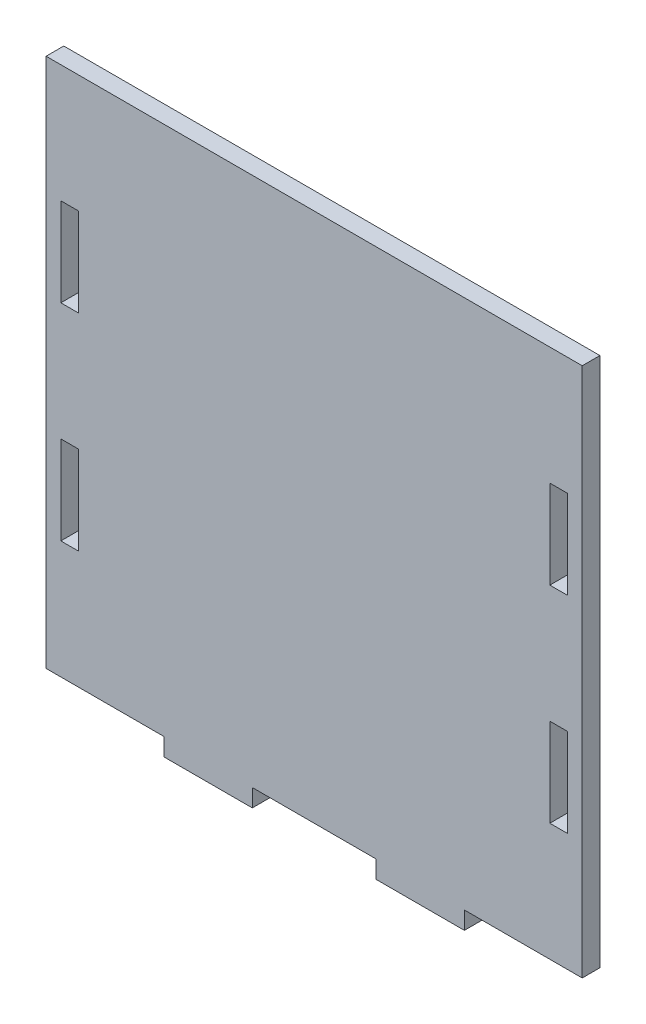
ISO-10303-21;
HEADER;
FILE_DESCRIPTION(('STEP AP214'),'2;1');
FILE_NAME('part.step','',(''),(''),'','','');
FILE_SCHEMA(('AUTOMOTIVE_DESIGN { 1 0 10303 214 1 1 1 1 }'));
ENDSEC;
DATA;
#1=APPLICATION_CONTEXT('core data for automotive mechanical design processes');
#2=APPLICATION_PROTOCOL_DEFINITION('international standard','automotive_design',2000,#1);
#3=PRODUCT_CONTEXT('',#1,'mechanical');
#4=PRODUCT('Part','Part','',(#3));
#5=PRODUCT_RELATED_PRODUCT_CATEGORY('part','',(#4));
#6=PRODUCT_DEFINITION_FORMATION('','',#4);
#7=PRODUCT_DEFINITION_CONTEXT('part definition',#1,'design');
#8=PRODUCT_DEFINITION('design','',#6,#7);
#9=PRODUCT_DEFINITION_SHAPE('','',#8);
#10=(LENGTH_UNIT() NAMED_UNIT(*) SI_UNIT(.MILLI.,.METRE.));
#11=(NAMED_UNIT(*) PLANE_ANGLE_UNIT() SI_UNIT($,.RADIAN.));
#12=(NAMED_UNIT(*) SI_UNIT($,.STERADIAN.) SOLID_ANGLE_UNIT());
#13=UNCERTAINTY_MEASURE_WITH_UNIT(LENGTH_MEASURE(1.E-05),#10,'distance_accuracy_value','');
#14=(GEOMETRIC_REPRESENTATION_CONTEXT(3) GLOBAL_UNCERTAINTY_ASSIGNED_CONTEXT((#13)) GLOBAL_UNIT_ASSIGNED_CONTEXT((#10,
#11,#12)) REPRESENTATION_CONTEXT('',''));
#15=CARTESIAN_POINT('',(0.,0.,0.));
#16=DIRECTION('',(0.,0.,1.));
#17=DIRECTION('',(1.,0.,0.));
#18=AXIS2_PLACEMENT_3D('',#15,#16,#17);
#19=CARTESIAN_POINT('',(45.5,0.,3.));
#20=DIRECTION('',(1.,0.,0.));
#21=DIRECTION('',(0.,1.,0.));
#22=AXIS2_PLACEMENT_3D('',#19,#20,#21);
#23=PLANE('',#22);
#24=DIRECTION('',(0.,-1.,0.));
#25=VECTOR('',#24,1.);
#26=CARTESIAN_POINT('',(45.5,0.,0.));
#27=LINE('',#26,#25);
#28=CARTESIAN_POINT('',(45.5,45.,0.));
#29=VERTEX_POINT('',#28);
#30=CARTESIAN_POINT('',(45.5,-45.,0.));
#31=VERTEX_POINT('',#30);
#32=EDGE_CURVE('E304',#29,#31,#27,.T.);
#33=ORIENTED_EDGE('',*,*,#32,.F.);
#34=DIRECTION('',(0.,0.,-1.));
#35=VECTOR('',#34,1.);
#36=CARTESIAN_POINT('',(45.5,45.,3.));
#37=LINE('',#36,#35);
#38=CARTESIAN_POINT('',(45.5,45.,3.));
#39=VERTEX_POINT('',#38);
#40=EDGE_CURVE('E11',#39,#29,#37,.T.);
#41=ORIENTED_EDGE('',*,*,#40,.F.);
#42=DIRECTION('',(0.,-1.,0.));
#43=VECTOR('',#42,1.);
#44=CARTESIAN_POINT('',(45.5,0.,3.));
#45=LINE('',#44,#43);
#46=CARTESIAN_POINT('',(45.5,-45.,3.));
#47=VERTEX_POINT('',#46);
#48=EDGE_CURVE('E545',#39,#47,#45,.T.);
#49=ORIENTED_EDGE('',*,*,#48,.T.);
#50=DIRECTION('',(0.,0.,-1.));
#51=VECTOR('',#50,1.);
#52=CARTESIAN_POINT('',(45.5,-45.,3.));
#53=LINE('',#52,#51);
#54=EDGE_CURVE('E148',#47,#31,#53,.T.);
#55=ORIENTED_EDGE('',*,*,#54,.T.);
#56=EDGE_LOOP('',(#33,#41,#49,#55));
#57=FACE_BOUND('',#56,.T.);
#58=ADVANCED_FACE('F35',(#57),#23,.T.);
#59=CARTESIAN_POINT('',(0.,45.,3.));
#60=DIRECTION('',(0.,1.,0.));
#61=DIRECTION('',(-1.,0.,0.));
#62=AXIS2_PLACEMENT_3D('',#59,#60,#61);
#63=PLANE('',#62);
#64=DIRECTION('',(1.,0.,0.));
#65=VECTOR('',#64,1.);
#66=CARTESIAN_POINT('',(0.,45.,0.));
#67=LINE('',#66,#65);
#68=CARTESIAN_POINT('',(-45.5,45.,0.));
#69=VERTEX_POINT('',#68);
#70=EDGE_CURVE('E307',#69,#29,#67,.T.);
#71=ORIENTED_EDGE('',*,*,#70,.F.);
#72=DIRECTION('',(0.,0.,-1.));
#73=VECTOR('',#72,1.);
#74=CARTESIAN_POINT('',(-45.5,45.,3.));
#75=LINE('',#74,#73);
#76=CARTESIAN_POINT('',(-45.5,45.,3.));
#77=VERTEX_POINT('',#76);
#78=EDGE_CURVE('E45',#77,#69,#75,.T.);
#79=ORIENTED_EDGE('',*,*,#78,.F.);
#80=DIRECTION('',(1.,0.,0.));
#81=VECTOR('',#80,1.);
#82=CARTESIAN_POINT('',(0.,45.,3.));
#83=LINE('',#82,#81);
#84=EDGE_CURVE('E547',#77,#39,#83,.T.);
#85=ORIENTED_EDGE('',*,*,#84,.T.);
#86=ORIENTED_EDGE('',*,*,#40,.T.);
#87=EDGE_LOOP('',(#71,#79,#85,#86));
#88=FACE_BOUND('',#87,.T.);
#89=ADVANCED_FACE('F417',(#88),#63,.T.);
#90=CARTESIAN_POINT('',(-45.5,0.,3.));
#91=DIRECTION('',(1.,0.,0.));
#92=DIRECTION('',(0.,1.,0.));
#93=AXIS2_PLACEMENT_3D('',#90,#91,#92);
#94=PLANE('',#93);
#95=DIRECTION('',(0.,-1.,0.));
#96=VECTOR('',#95,1.);
#97=CARTESIAN_POINT('',(-45.5,0.,0.));
#98=LINE('',#97,#96);
#99=CARTESIAN_POINT('',(-45.5,-45.,0.));
#100=VERTEX_POINT('',#99);
#101=EDGE_CURVE('E310',#69,#100,#98,.T.);
#102=ORIENTED_EDGE('',*,*,#101,.T.);
#103=DIRECTION('',(0.,0.,-1.));
#104=VECTOR('',#103,1.);
#105=CARTESIAN_POINT('',(-45.5,-45.,3.));
#106=LINE('',#105,#104);
#107=CARTESIAN_POINT('',(-45.5,-45.,3.));
#108=VERTEX_POINT('',#107);
#109=EDGE_CURVE('E350',#108,#100,#106,.T.);
#110=ORIENTED_EDGE('',*,*,#109,.F.);
#111=DIRECTION('',(0.,-1.,0.));
#112=VECTOR('',#111,1.);
#113=CARTESIAN_POINT('',(-45.5,0.,3.));
#114=LINE('',#113,#112);
#115=EDGE_CURVE('E550',#77,#108,#114,.T.);
#116=ORIENTED_EDGE('',*,*,#115,.F.);
#117=ORIENTED_EDGE('',*,*,#78,.T.);
#118=EDGE_LOOP('',(#102,#110,#116,#117));
#119=FACE_BOUND('',#118,.T.);
#120=ADVANCED_FACE('F422',(#119),#94,.F.);
#121=CARTESIAN_POINT('',(0.,-45.,3.));
#122=DIRECTION('',(0.,1.,0.));
#123=DIRECTION('',(-1.,0.,0.));
#124=AXIS2_PLACEMENT_3D('',#121,#122,#123);
#125=PLANE('',#124);
#126=DIRECTION('',(1.,0.,0.));
#127=VECTOR('',#126,1.);
#128=CARTESIAN_POINT('',(0.,-45.,0.));
#129=LINE('',#128,#127);
#130=CARTESIAN_POINT('',(-25.5,-45.,0.));
#131=VERTEX_POINT('',#130);
#132=EDGE_CURVE('E313',#100,#131,#129,.T.);
#133=ORIENTED_EDGE('',*,*,#132,.T.);
#134=DIRECTION('',(0.,0.,-1.));
#135=VECTOR('',#134,1.);
#136=CARTESIAN_POINT('',(-25.5,-45.,3.));
#137=LINE('',#136,#135);
#138=CARTESIAN_POINT('',(-25.5,-45.,3.));
#139=VERTEX_POINT('',#138);
#140=EDGE_CURVE('E347',#139,#131,#137,.T.);
#141=ORIENTED_EDGE('',*,*,#140,.F.);
#142=DIRECTION('',(1.,0.,0.));
#143=VECTOR('',#142,1.);
#144=CARTESIAN_POINT('',(0.,-45.,3.));
#145=LINE('',#144,#143);
#146=EDGE_CURVE('E254',#108,#139,#145,.T.);
#147=ORIENTED_EDGE('',*,*,#146,.F.);
#148=ORIENTED_EDGE('',*,*,#109,.T.);
#149=EDGE_LOOP('',(#133,#141,#147,#148));
#150=FACE_BOUND('',#149,.T.);
#151=ADVANCED_FACE('F475',(#150),#125,.F.);
#152=CARTESIAN_POINT('',(-25.5,0.,3.));
#153=DIRECTION('',(1.,0.,0.));
#154=DIRECTION('',(0.,0.,-1.));
#155=AXIS2_PLACEMENT_3D('',#152,#153,#154);
#156=PLANE('',#155);
#157=DIRECTION('',(0.,-1.,0.));
#158=VECTOR('',#157,1.);
#159=CARTESIAN_POINT('',(-25.5,0.,0.));
#160=LINE('',#159,#158);
#161=CARTESIAN_POINT('',(-25.5,-48.,0.));
#162=VERTEX_POINT('',#161);
#163=EDGE_CURVE('E316',#131,#162,#160,.T.);
#164=ORIENTED_EDGE('',*,*,#163,.T.);
#165=DIRECTION('',(0.,0.,-1.));
#166=VECTOR('',#165,1.);
#167=CARTESIAN_POINT('',(-25.5,-48.,3.));
#168=LINE('',#167,#166);
#169=CARTESIAN_POINT('',(-25.5,-48.,3.));
#170=VERTEX_POINT('',#169);
#171=EDGE_CURVE('E344',#170,#162,#168,.T.);
#172=ORIENTED_EDGE('',*,*,#171,.F.);
#173=DIRECTION('',(0.,-1.,0.));
#174=VECTOR('',#173,1.);
#175=CARTESIAN_POINT('',(-25.5,0.,3.));
#176=LINE('',#175,#174);
#177=EDGE_CURVE('E554',#139,#170,#176,.T.);
#178=ORIENTED_EDGE('',*,*,#177,.F.);
#179=ORIENTED_EDGE('',*,*,#140,.T.);
#180=EDGE_LOOP('',(#164,#172,#178,#179));
#181=FACE_BOUND('',#180,.T.);
#182=ADVANCED_FACE('F485',(#181),#156,.F.);
#183=CARTESIAN_POINT('',(0.,-48.,3.));
#184=DIRECTION('',(0.,1.,0.));
#185=DIRECTION('',(-1.,0.,0.));
#186=AXIS2_PLACEMENT_3D('',#183,#184,#185);
#187=PLANE('',#186);
#188=DIRECTION('',(1.,0.,0.));
#189=VECTOR('',#188,1.);
#190=CARTESIAN_POINT('',(0.,-48.,0.));
#191=LINE('',#190,#189);
#192=CARTESIAN_POINT('',(-10.5,-48.,0.));
#193=VERTEX_POINT('',#192);
#194=EDGE_CURVE('E321',#162,#193,#191,.T.);
#195=ORIENTED_EDGE('',*,*,#194,.T.);
#196=DIRECTION('',(0.,0.,-1.));
#197=VECTOR('',#196,1.);
#198=CARTESIAN_POINT('',(-10.5,-48.,3.));
#199=LINE('',#198,#197);
#200=CARTESIAN_POINT('',(-10.5,-48.,3.));
#201=VERTEX_POINT('',#200);
#202=EDGE_CURVE('E342',#201,#193,#199,.T.);
#203=ORIENTED_EDGE('',*,*,#202,.F.);
#204=DIRECTION('',(1.,0.,0.));
#205=VECTOR('',#204,1.);
#206=CARTESIAN_POINT('',(0.,-48.,3.));
#207=LINE('',#206,#205);
#208=EDGE_CURVE('E557',#170,#201,#207,.T.);
#209=ORIENTED_EDGE('',*,*,#208,.F.);
#210=ORIENTED_EDGE('',*,*,#171,.T.);
#211=EDGE_LOOP('',(#195,#203,#209,#210));
#212=FACE_BOUND('',#211,.T.);
#213=ADVANCED_FACE('F497',(#212),#187,.F.);
#214=CARTESIAN_POINT('',(-10.5,0.,3.));
#215=DIRECTION('',(1.,0.,0.));
#216=DIRECTION('',(0.,0.,-1.));
#217=AXIS2_PLACEMENT_3D('',#214,#215,#216);
#218=PLANE('',#217);
#219=DIRECTION('',(0.,-1.,0.));
#220=VECTOR('',#219,1.);
#221=CARTESIAN_POINT('',(-10.5,0.,0.));
#222=LINE('',#221,#220);
#223=CARTESIAN_POINT('',(-10.5,-45.,0.));
#224=VERTEX_POINT('',#223);
#225=EDGE_CURVE('E324',#224,#193,#222,.T.);
#226=ORIENTED_EDGE('',*,*,#225,.F.);
#227=DIRECTION('',(0.,0.,-1.));
#228=VECTOR('',#227,1.);
#229=CARTESIAN_POINT('',(-10.5,-45.,3.));
#230=LINE('',#229,#228);
#231=CARTESIAN_POINT('',(-10.5,-45.,3.));
#232=VERTEX_POINT('',#231);
#233=EDGE_CURVE('E340',#232,#224,#230,.T.);
#234=ORIENTED_EDGE('',*,*,#233,.F.);
#235=DIRECTION('',(0.,-1.,0.));
#236=VECTOR('',#235,1.);
#237=CARTESIAN_POINT('',(-10.5,0.,3.));
#238=LINE('',#237,#236);
#239=EDGE_CURVE('E559',#232,#201,#238,.T.);
#240=ORIENTED_EDGE('',*,*,#239,.T.);
#241=ORIENTED_EDGE('',*,*,#202,.T.);
#242=EDGE_LOOP('',(#226,#234,#240,#241));
#243=FACE_BOUND('',#242,.T.);
#244=ADVANCED_FACE('F489',(#243),#218,.T.);
#245=CARTESIAN_POINT('',(10.5,-45.,0.));
#246=VERTEX_POINT('',#245);
#247=EDGE_CURVE('E318',#224,#246,#129,.T.);
#248=ORIENTED_EDGE('',*,*,#247,.T.);
#249=DIRECTION('',(0.,0.,-1.));
#250=VECTOR('',#249,1.);
#251=CARTESIAN_POINT('',(10.5,-45.,3.));
#252=LINE('',#251,#250);
#253=CARTESIAN_POINT('',(10.5,-45.,3.));
#254=VERTEX_POINT('',#253);
#255=EDGE_CURVE('E337',#254,#246,#252,.T.);
#256=ORIENTED_EDGE('',*,*,#255,.F.);
#257=EDGE_CURVE('E253',#232,#254,#145,.T.);
#258=ORIENTED_EDGE('',*,*,#257,.F.);
#259=ORIENTED_EDGE('',*,*,#233,.T.);
#260=EDGE_LOOP('',(#248,#256,#258,#259));
#261=FACE_BOUND('',#260,.T.);
#262=ADVANCED_FACE('F476',(#261),#125,.F.);
#263=CARTESIAN_POINT('',(10.5,0.,3.));
#264=DIRECTION('',(1.,0.,0.));
#265=DIRECTION('',(0.,0.,-1.));
#266=AXIS2_PLACEMENT_3D('',#263,#264,#265);
#267=PLANE('',#266);
#268=DIRECTION('',(0.,-1.,0.));
#269=VECTOR('',#268,1.);
#270=CARTESIAN_POINT('',(10.5,0.,0.));
#271=LINE('',#270,#269);
#272=CARTESIAN_POINT('',(10.5,-48.,0.));
#273=VERTEX_POINT('',#272);
#274=EDGE_CURVE('E327',#246,#273,#271,.T.);
#275=ORIENTED_EDGE('',*,*,#274,.T.);
#276=DIRECTION('',(0.,0.,-1.));
#277=VECTOR('',#276,1.);
#278=CARTESIAN_POINT('',(10.5,-48.,3.));
#279=LINE('',#278,#277);
#280=CARTESIAN_POINT('',(10.5,-48.,3.));
#281=VERTEX_POINT('',#280);
#282=EDGE_CURVE('E247',#281,#273,#279,.T.);
#283=ORIENTED_EDGE('',*,*,#282,.F.);
#284=DIRECTION('',(0.,-1.,0.));
#285=VECTOR('',#284,1.);
#286=CARTESIAN_POINT('',(10.5,0.,3.));
#287=LINE('',#286,#285);
#288=EDGE_CURVE('E235',#254,#281,#287,.T.);
#289=ORIENTED_EDGE('',*,*,#288,.F.);
#290=ORIENTED_EDGE('',*,*,#255,.T.);
#291=EDGE_LOOP('',(#275,#283,#289,#290));
#292=FACE_BOUND('',#291,.T.);
#293=ADVANCED_FACE('F488',(#292),#267,.F.);
#294=CARTESIAN_POINT('',(0.,-48.,3.));
#295=DIRECTION('',(0.,1.,0.));
#296=DIRECTION('',(0.,0.,1.));
#297=AXIS2_PLACEMENT_3D('',#294,#295,#296);
#298=PLANE('',#297);
#299=DIRECTION('',(1.,0.,0.));
#300=VECTOR('',#299,1.);
#301=CARTESIAN_POINT('',(0.,-48.,0.));
#302=LINE('',#301,#300);
#303=CARTESIAN_POINT('',(25.5,-48.,0.));
#304=VERTEX_POINT('',#303);
#305=EDGE_CURVE('E243',#273,#304,#302,.T.);
#306=ORIENTED_EDGE('',*,*,#305,.T.);
#307=DIRECTION('',(0.,0.,-1.));
#308=VECTOR('',#307,1.);
#309=CARTESIAN_POINT('',(25.5,-48.,3.));
#310=LINE('',#309,#308);
#311=CARTESIAN_POINT('',(25.5,-48.,3.));
#312=VERTEX_POINT('',#311);
#313=EDGE_CURVE('E241',#312,#304,#310,.T.);
#314=ORIENTED_EDGE('',*,*,#313,.F.);
#315=DIRECTION('',(1.,0.,0.));
#316=VECTOR('',#315,1.);
#317=CARTESIAN_POINT('',(0.,-48.,3.));
#318=LINE('',#317,#316);
#319=EDGE_CURVE('E229',#281,#312,#318,.T.);
#320=ORIENTED_EDGE('',*,*,#319,.F.);
#321=ORIENTED_EDGE('',*,*,#282,.T.);
#322=EDGE_LOOP('',(#306,#314,#320,#321));
#323=FACE_BOUND('',#322,.T.);
#324=ADVANCED_FACE('F242',(#323),#298,.F.);
#325=CARTESIAN_POINT('',(25.5,0.,3.));
#326=DIRECTION('',(1.,0.,0.));
#327=DIRECTION('',(0.,0.,-1.));
#328=AXIS2_PLACEMENT_3D('',#325,#326,#327);
#329=PLANE('',#328);
#330=DIRECTION('',(0.,-1.,0.));
#331=VECTOR('',#330,1.);
#332=CARTESIAN_POINT('',(25.5,0.,0.));
#333=LINE('',#332,#331);
#334=CARTESIAN_POINT('',(25.5,-45.,0.));
#335=VERTEX_POINT('',#334);
#336=EDGE_CURVE('E331',#335,#304,#333,.T.);
#337=ORIENTED_EDGE('',*,*,#336,.F.);
#338=DIRECTION('',(0.,0.,-1.));
#339=VECTOR('',#338,1.);
#340=CARTESIAN_POINT('',(25.5,-45.,3.));
#341=LINE('',#340,#339);
#342=CARTESIAN_POINT('',(25.5,-45.,3.));
#343=VERTEX_POINT('',#342);
#344=EDGE_CURVE('E141',#343,#335,#341,.T.);
#345=ORIENTED_EDGE('',*,*,#344,.F.);
#346=DIRECTION('',(0.,-1.,0.));
#347=VECTOR('',#346,1.);
#348=CARTESIAN_POINT('',(25.5,0.,3.));
#349=LINE('',#348,#347);
#350=EDGE_CURVE('E233',#343,#312,#349,.T.);
#351=ORIENTED_EDGE('',*,*,#350,.T.);
#352=ORIENTED_EDGE('',*,*,#313,.T.);
#353=EDGE_LOOP('',(#337,#345,#351,#352));
#354=FACE_BOUND('',#353,.T.);
#355=ADVANCED_FACE('F249',(#354),#329,.T.);
#356=CARTESIAN_POINT('',(40.,0.,3.));
#357=DIRECTION('',(1.,0.,0.));
#358=DIRECTION('',(0.,0.,-1.));
#359=AXIS2_PLACEMENT_3D('',#356,#357,#358);
#360=PLANE('',#359);
#361=DIRECTION('',(0.,-1.,0.));
#362=VECTOR('',#361,1.);
#363=CARTESIAN_POINT('',(40.,0.,0.));
#364=LINE('',#363,#362);
#365=CARTESIAN_POINT('',(40.,25.,0.));
#366=VERTEX_POINT('',#365);
#367=CARTESIAN_POINT('',(40.,10.,0.));
#368=VERTEX_POINT('',#367);
#369=EDGE_CURVE('E292',#366,#368,#364,.T.);
#370=ORIENTED_EDGE('',*,*,#369,.F.);
#371=DIRECTION('',(0.,0.,-1.));
#372=VECTOR('',#371,1.);
#373=CARTESIAN_POINT('',(40.,25.,3.));
#374=LINE('',#373,#372);
#375=CARTESIAN_POINT('',(40.,25.,3.));
#376=VERTEX_POINT('',#375);
#377=EDGE_CURVE('E334',#376,#366,#374,.T.);
#378=ORIENTED_EDGE('',*,*,#377,.F.);
#379=DIRECTION('',(0.,-1.,0.));
#380=VECTOR('',#379,1.);
#381=CARTESIAN_POINT('',(40.,0.,3.));
#382=LINE('',#381,#380);
#383=CARTESIAN_POINT('',(40.,10.,3.));
#384=VERTEX_POINT('',#383);
#385=EDGE_CURVE('E534',#376,#384,#382,.T.);
#386=ORIENTED_EDGE('',*,*,#385,.T.);
#387=DIRECTION('',(0.,0.,-1.));
#388=VECTOR('',#387,1.);
#389=CARTESIAN_POINT('',(40.,10.,3.));
#390=LINE('',#389,#388);
#391=EDGE_CURVE('E354',#384,#368,#390,.T.);
#392=ORIENTED_EDGE('',*,*,#391,.T.);
#393=EDGE_LOOP('',(#370,#378,#386,#392));
#394=FACE_BOUND('',#393,.T.);
#395=ADVANCED_FACE('F435',(#394),#360,.T.);
#396=CARTESIAN_POINT('',(0.,25.,3.));
#397=DIRECTION('',(0.,-1.,0.));
#398=DIRECTION('',(0.,0.,-1.));
#399=AXIS2_PLACEMENT_3D('',#396,#397,#398);
#400=PLANE('',#399);
#401=DIRECTION('',(-1.,0.,0.));
#402=VECTOR('',#401,1.);
#403=CARTESIAN_POINT('',(0.,25.,0.));
#404=LINE('',#403,#402);
#405=CARTESIAN_POINT('',(43.,25.,0.));
#406=VERTEX_POINT('',#405);
#407=EDGE_CURVE('E295',#406,#366,#404,.T.);
#408=ORIENTED_EDGE('',*,*,#407,.F.);
#409=DIRECTION('',(0.,0.,-1.));
#410=VECTOR('',#409,1.);
#411=CARTESIAN_POINT('',(43.,25.,3.));
#412=LINE('',#411,#410);
#413=CARTESIAN_POINT('',(43.,25.,3.));
#414=VERTEX_POINT('',#413);
#415=EDGE_CURVE('E360',#414,#406,#412,.T.);
#416=ORIENTED_EDGE('',*,*,#415,.F.);
#417=DIRECTION('',(-1.,0.,0.));
#418=VECTOR('',#417,1.);
#419=CARTESIAN_POINT('',(0.,25.,3.));
#420=LINE('',#419,#418);
#421=EDGE_CURVE('E537',#414,#376,#420,.T.);
#422=ORIENTED_EDGE('',*,*,#421,.T.);
#423=ORIENTED_EDGE('',*,*,#377,.T.);
#424=EDGE_LOOP('',(#408,#416,#422,#423));
#425=FACE_BOUND('',#424,.T.);
#426=ADVANCED_FACE('F431',(#425),#400,.T.);
#427=CARTESIAN_POINT('',(43.,0.,3.));
#428=DIRECTION('',(1.,0.,0.));
#429=DIRECTION('',(0.,1.,0.));
#430=AXIS2_PLACEMENT_3D('',#427,#428,#429);
#431=PLANE('',#430);
#432=DIRECTION('',(0.,-1.,0.));
#433=VECTOR('',#432,1.);
#434=CARTESIAN_POINT('',(43.,0.,0.));
#435=LINE('',#434,#433);
#436=CARTESIAN_POINT('',(43.,10.,0.));
#437=VERTEX_POINT('',#436);
#438=EDGE_CURVE('E298',#406,#437,#435,.T.);
#439=ORIENTED_EDGE('',*,*,#438,.T.);
#440=DIRECTION('',(0.,0.,-1.));
#441=VECTOR('',#440,1.);
#442=CARTESIAN_POINT('',(43.,10.,3.));
#443=LINE('',#442,#441);
#444=CARTESIAN_POINT('',(43.,10.,3.));
#445=VERTEX_POINT('',#444);
#446=EDGE_CURVE('E356',#445,#437,#443,.T.);
#447=ORIENTED_EDGE('',*,*,#446,.F.);
#448=DIRECTION('',(0.,-1.,0.));
#449=VECTOR('',#448,1.);
#450=CARTESIAN_POINT('',(43.,0.,3.));
#451=LINE('',#450,#449);
#452=EDGE_CURVE('E540',#414,#445,#451,.T.);
#453=ORIENTED_EDGE('',*,*,#452,.F.);
#454=ORIENTED_EDGE('',*,*,#415,.T.);
#455=EDGE_LOOP('',(#439,#447,#453,#454));
#456=FACE_BOUND('',#455,.T.);
#457=ADVANCED_FACE('F427',(#456),#431,.F.);
#458=CARTESIAN_POINT('',(40.,0.,3.));
#459=DIRECTION('',(1.,0.,0.));
#460=DIRECTION('',(0.,1.,0.));
#461=AXIS2_PLACEMENT_3D('',#458,#459,#460);
#462=PLANE('',#461);
#463=DIRECTION('',(0.,-1.,0.));
#464=VECTOR('',#463,1.);
#465=CARTESIAN_POINT('',(40.,0.,0.));
#466=LINE('',#465,#464);
#467=CARTESIAN_POINT('',(40.,-10.,0.));
#468=VERTEX_POINT('',#467);
#469=CARTESIAN_POINT('',(40.,-25.,0.));
#470=VERTEX_POINT('',#469);
#471=EDGE_CURVE('E280',#468,#470,#466,.T.);
#472=ORIENTED_EDGE('',*,*,#471,.F.);
#473=DIRECTION('',(0.,0.,-1.));
#474=VECTOR('',#473,1.);
#475=CARTESIAN_POINT('',(40.,-10.,3.));
#476=LINE('',#475,#474);
#477=CARTESIAN_POINT('',(40.,-10.,3.));
#478=VERTEX_POINT('',#477);
#479=EDGE_CURVE('E357',#478,#468,#476,.T.);
#480=ORIENTED_EDGE('',*,*,#479,.F.);
#481=DIRECTION('',(0.,-1.,0.));
#482=VECTOR('',#481,1.);
#483=CARTESIAN_POINT('',(40.,0.,3.));
#484=LINE('',#483,#482);
#485=CARTESIAN_POINT('',(40.,-25.,3.));
#486=VERTEX_POINT('',#485);
#487=EDGE_CURVE('E523',#478,#486,#484,.T.);
#488=ORIENTED_EDGE('',*,*,#487,.T.);
#489=DIRECTION('',(0.,0.,-1.));
#490=VECTOR('',#489,1.);
#491=CARTESIAN_POINT('',(40.,-25.,3.));
#492=LINE('',#491,#490);
#493=EDGE_CURVE('E363',#486,#470,#492,.T.);
#494=ORIENTED_EDGE('',*,*,#493,.T.);
#495=EDGE_LOOP('',(#472,#480,#488,#494));
#496=FACE_BOUND('',#495,.T.);
#497=ADVANCED_FACE('F430',(#496),#462,.T.);
#498=CARTESIAN_POINT('',(0.,-9.99999999999998,3.));
#499=DIRECTION('',(0.,-1.,0.));
#500=DIRECTION('',(1.,0.,0.));
#501=AXIS2_PLACEMENT_3D('',#498,#499,#500);
#502=PLANE('',#501);
#503=DIRECTION('',(-1.,0.,0.));
#504=VECTOR('',#503,1.);
#505=CARTESIAN_POINT('',(0.,-9.99999999999998,0.));
#506=LINE('',#505,#504);
#507=CARTESIAN_POINT('',(43.,-10.,0.));
#508=VERTEX_POINT('',#507);
#509=EDGE_CURVE('E283',#508,#468,#506,.T.);
#510=ORIENTED_EDGE('',*,*,#509,.F.);
#511=DIRECTION('',(0.,0.,-1.));
#512=VECTOR('',#511,1.);
#513=CARTESIAN_POINT('',(43.,-10.,3.));
#514=LINE('',#513,#512);
#515=CARTESIAN_POINT('',(43.,-10.,3.));
#516=VERTEX_POINT('',#515);
#517=EDGE_CURVE('E369',#516,#508,#514,.T.);
#518=ORIENTED_EDGE('',*,*,#517,.F.);
#519=DIRECTION('',(-1.,0.,0.));
#520=VECTOR('',#519,1.);
#521=CARTESIAN_POINT('',(0.,-9.99999999999998,3.));
#522=LINE('',#521,#520);
#523=EDGE_CURVE('E526',#516,#478,#522,.T.);
#524=ORIENTED_EDGE('',*,*,#523,.T.);
#525=ORIENTED_EDGE('',*,*,#479,.T.);
#526=EDGE_LOOP('',(#510,#518,#524,#525));
#527=FACE_BOUND('',#526,.T.);
#528=ADVANCED_FACE('F448',(#527),#502,.T.);
#529=CARTESIAN_POINT('',(43.,0.,3.));
#530=DIRECTION('',(1.,0.,0.));
#531=DIRECTION('',(0.,0.,-1.));
#532=AXIS2_PLACEMENT_3D('',#529,#530,#531);
#533=PLANE('',#532);
#534=DIRECTION('',(0.,-1.,0.));
#535=VECTOR('',#534,1.);
#536=CARTESIAN_POINT('',(43.,0.,0.));
#537=LINE('',#536,#535);
#538=CARTESIAN_POINT('',(43.,-25.,0.));
#539=VERTEX_POINT('',#538);
#540=EDGE_CURVE('E286',#508,#539,#537,.T.);
#541=ORIENTED_EDGE('',*,*,#540,.T.);
#542=DIRECTION('',(0.,0.,-1.));
#543=VECTOR('',#542,1.);
#544=CARTESIAN_POINT('',(43.,-25.,3.));
#545=LINE('',#544,#543);
#546=CARTESIAN_POINT('',(43.,-25.,3.));
#547=VERTEX_POINT('',#546);
#548=EDGE_CURVE('E365',#547,#539,#545,.T.);
#549=ORIENTED_EDGE('',*,*,#548,.F.);
#550=DIRECTION('',(0.,-1.,0.));
#551=VECTOR('',#550,1.);
#552=CARTESIAN_POINT('',(43.,0.,3.));
#553=LINE('',#552,#551);
#554=EDGE_CURVE('E529',#516,#547,#553,.T.);
#555=ORIENTED_EDGE('',*,*,#554,.F.);
#556=ORIENTED_EDGE('',*,*,#517,.T.);
#557=EDGE_LOOP('',(#541,#549,#555,#556));
#558=FACE_BOUND('',#557,.T.);
#559=ADVANCED_FACE('F444',(#558),#533,.F.);
#560=CARTESIAN_POINT('',(-43.,0.,3.));
#561=DIRECTION('',(1.,0.,0.));
#562=DIRECTION('',(0.,0.,-1.));
#563=AXIS2_PLACEMENT_3D('',#560,#561,#562);
#564=PLANE('',#563);
#565=DIRECTION('',(0.,-1.,0.));
#566=VECTOR('',#565,1.);
#567=CARTESIAN_POINT('',(-43.,0.,0.));
#568=LINE('',#567,#566);
#569=CARTESIAN_POINT('',(-43.,-10.,0.));
#570=VERTEX_POINT('',#569);
#571=CARTESIAN_POINT('',(-43.,-25.,0.));
#572=VERTEX_POINT('',#571);
#573=EDGE_CURVE('E268',#570,#572,#568,.T.);
#574=ORIENTED_EDGE('',*,*,#573,.F.);
#575=DIRECTION('',(0.,0.,-1.));
#576=VECTOR('',#575,1.);
#577=CARTESIAN_POINT('',(-43.,-10.,3.));
#578=LINE('',#577,#576);
#579=CARTESIAN_POINT('',(-43.,-10.,3.));
#580=VERTEX_POINT('',#579);
#581=EDGE_CURVE('E366',#580,#570,#578,.T.);
#582=ORIENTED_EDGE('',*,*,#581,.F.);
#583=DIRECTION('',(0.,-1.,0.));
#584=VECTOR('',#583,1.);
#585=CARTESIAN_POINT('',(-43.,0.,3.));
#586=LINE('',#585,#584);
#587=CARTESIAN_POINT('',(-43.,-25.,3.));
#588=VERTEX_POINT('',#587);
#589=EDGE_CURVE('E512',#580,#588,#586,.T.);
#590=ORIENTED_EDGE('',*,*,#589,.T.);
#591=DIRECTION('',(0.,0.,-1.));
#592=VECTOR('',#591,1.);
#593=CARTESIAN_POINT('',(-43.,-25.,3.));
#594=LINE('',#593,#592);
#595=EDGE_CURVE('E372',#588,#572,#594,.T.);
#596=ORIENTED_EDGE('',*,*,#595,.T.);
#597=EDGE_LOOP('',(#574,#582,#590,#596));
#598=FACE_BOUND('',#597,.T.);
#599=ADVANCED_FACE('F447',(#598),#564,.T.);
#600=CARTESIAN_POINT('',(0.,-9.99999999999999,3.));
#601=DIRECTION('',(0.,1.,0.));
#602=DIRECTION('',(-1.,0.,0.));
#603=AXIS2_PLACEMENT_3D('',#600,#601,#602);
#604=PLANE('',#603);
#605=DIRECTION('',(1.,0.,0.));
#606=VECTOR('',#605,1.);
#607=CARTESIAN_POINT('',(0.,-9.99999999999999,0.));
#608=LINE('',#607,#606);
#609=CARTESIAN_POINT('',(-40.,-10.,0.));
#610=VERTEX_POINT('',#609);
#611=EDGE_CURVE('E271',#570,#610,#608,.T.);
#612=ORIENTED_EDGE('',*,*,#611,.T.);
#613=DIRECTION('',(0.,0.,-1.));
#614=VECTOR('',#613,1.);
#615=CARTESIAN_POINT('',(-40.,-10.,3.));
#616=LINE('',#615,#614);
#617=CARTESIAN_POINT('',(-40.,-10.,3.));
#618=VERTEX_POINT('',#617);
#619=EDGE_CURVE('E376',#618,#610,#616,.T.);
#620=ORIENTED_EDGE('',*,*,#619,.F.);
#621=DIRECTION('',(1.,0.,0.));
#622=VECTOR('',#621,1.);
#623=CARTESIAN_POINT('',(0.,-9.99999999999999,3.));
#624=LINE('',#623,#622);
#625=EDGE_CURVE('E515',#580,#618,#624,.T.);
#626=ORIENTED_EDGE('',*,*,#625,.F.);
#627=ORIENTED_EDGE('',*,*,#581,.T.);
#628=EDGE_LOOP('',(#612,#620,#626,#627));
#629=FACE_BOUND('',#628,.T.);
#630=ADVANCED_FACE('F462',(#629),#604,.F.);
#631=CARTESIAN_POINT('',(-40.,0.,3.));
#632=DIRECTION('',(1.,0.,0.));
#633=DIRECTION('',(0.,1.,0.));
#634=AXIS2_PLACEMENT_3D('',#631,#632,#633);
#635=PLANE('',#634);
#636=DIRECTION('',(0.,-1.,0.));
#637=VECTOR('',#636,1.);
#638=CARTESIAN_POINT('',(-40.,0.,0.));
#639=LINE('',#638,#637);
#640=CARTESIAN_POINT('',(-40.,-25.,0.));
#641=VERTEX_POINT('',#640);
#642=EDGE_CURVE('E274',#610,#641,#639,.T.);
#643=ORIENTED_EDGE('',*,*,#642,.T.);
#644=DIRECTION('',(0.,0.,-1.));
#645=VECTOR('',#644,1.);
#646=CARTESIAN_POINT('',(-40.,-25.,3.));
#647=LINE('',#646,#645);
#648=CARTESIAN_POINT('',(-40.,-25.,3.));
#649=VERTEX_POINT('',#648);
#650=EDGE_CURVE('E374',#649,#641,#647,.T.);
#651=ORIENTED_EDGE('',*,*,#650,.F.);
#652=DIRECTION('',(0.,-1.,0.));
#653=VECTOR('',#652,1.);
#654=CARTESIAN_POINT('',(-40.,0.,3.));
#655=LINE('',#654,#653);
#656=EDGE_CURVE('E518',#618,#649,#655,.T.);
#657=ORIENTED_EDGE('',*,*,#656,.F.);
#658=ORIENTED_EDGE('',*,*,#619,.T.);
#659=EDGE_LOOP('',(#643,#651,#657,#658));
#660=FACE_BOUND('',#659,.T.);
#661=ADVANCED_FACE('F459',(#660),#635,.F.);
#662=CARTESIAN_POINT('',(-43.,0.,3.));
#663=DIRECTION('',(1.,0.,0.));
#664=DIRECTION('',(0.,1.,0.));
#665=AXIS2_PLACEMENT_3D('',#662,#663,#664);
#666=PLANE('',#665);
#667=DIRECTION('',(0.,-1.,0.));
#668=VECTOR('',#667,1.);
#669=CARTESIAN_POINT('',(-43.,0.,0.));
#670=LINE('',#669,#668);
#671=CARTESIAN_POINT('',(-43.,25.,0.));
#672=VERTEX_POINT('',#671);
#673=CARTESIAN_POINT('',(-43.,9.99999999999999,0.));
#674=VERTEX_POINT('',#673);
#675=EDGE_CURVE('E257',#672,#674,#670,.T.);
#676=ORIENTED_EDGE('',*,*,#675,.F.);
#677=DIRECTION('',(0.,0.,-1.));
#678=VECTOR('',#677,1.);
#679=CARTESIAN_POINT('',(-43.,25.,3.));
#680=LINE('',#679,#678);
#681=CARTESIAN_POINT('',(-43.,25.,3.));
#682=VERTEX_POINT('',#681);
#683=EDGE_CURVE('E39',#682,#672,#680,.T.);
#684=ORIENTED_EDGE('',*,*,#683,.F.);
#685=DIRECTION('',(0.,-1.,0.));
#686=VECTOR('',#685,1.);
#687=CARTESIAN_POINT('',(-43.,0.,3.));
#688=LINE('',#687,#686);
#689=CARTESIAN_POINT('',(-43.,9.99999999999999,3.));
#690=VERTEX_POINT('',#689);
#691=EDGE_CURVE('E397',#682,#690,#688,.T.);
#692=ORIENTED_EDGE('',*,*,#691,.T.);
#693=DIRECTION('',(0.,0.,-1.));
#694=VECTOR('',#693,1.);
#695=CARTESIAN_POINT('',(-43.,9.99999999999999,3.));
#696=LINE('',#695,#694);
#697=EDGE_CURVE('E251',#690,#674,#696,.T.);
#698=ORIENTED_EDGE('',*,*,#697,.T.);
#699=EDGE_LOOP('',(#676,#684,#692,#698));
#700=FACE_BOUND('',#699,.T.);
#701=ADVANCED_FACE('F37',(#700),#666,.T.);
#702=CARTESIAN_POINT('',(0.,25.,3.));
#703=DIRECTION('',(0.,1.,0.));
#704=DIRECTION('',(0.,0.,1.));
#705=AXIS2_PLACEMENT_3D('',#702,#703,#704);
#706=PLANE('',#705);
#707=DIRECTION('',(1.,0.,0.));
#708=VECTOR('',#707,1.);
#709=CARTESIAN_POINT('',(0.,25.,0.));
#710=LINE('',#709,#708);
#711=CARTESIAN_POINT('',(-40.,25.,0.));
#712=VERTEX_POINT('',#711);
#713=EDGE_CURVE('E260',#672,#712,#710,.T.);
#714=ORIENTED_EDGE('',*,*,#713,.T.);
#715=DIRECTION('',(0.,0.,-1.));
#716=VECTOR('',#715,1.);
#717=CARTESIAN_POINT('',(-40.,25.,3.));
#718=LINE('',#717,#716);
#719=CARTESIAN_POINT('',(-40.,25.,3.));
#720=VERTEX_POINT('',#719);
#721=EDGE_CURVE('E382',#720,#712,#718,.T.);
#722=ORIENTED_EDGE('',*,*,#721,.F.);
#723=DIRECTION('',(1.,0.,0.));
#724=VECTOR('',#723,1.);
#725=CARTESIAN_POINT('',(0.,25.,3.));
#726=LINE('',#725,#724);
#727=EDGE_CURVE('E391',#682,#720,#726,.T.);
#728=ORIENTED_EDGE('',*,*,#727,.F.);
#729=ORIENTED_EDGE('',*,*,#683,.T.);
#730=EDGE_LOOP('',(#714,#722,#728,#729));
#731=FACE_BOUND('',#730,.T.);
#732=ADVANCED_FACE('F390',(#731),#706,.F.);
#733=CARTESIAN_POINT('',(-40.,0.,3.));
#734=DIRECTION('',(1.,0.,0.));
#735=DIRECTION('',(0.,0.,-1.));
#736=AXIS2_PLACEMENT_3D('',#733,#734,#735);
#737=PLANE('',#736);
#738=DIRECTION('',(0.,-1.,0.));
#739=VECTOR('',#738,1.);
#740=CARTESIAN_POINT('',(-40.,0.,0.));
#741=LINE('',#740,#739);
#742=CARTESIAN_POINT('',(-40.,9.99999999999999,0.));
#743=VERTEX_POINT('',#742);
#744=EDGE_CURVE('E262',#712,#743,#741,.T.);
#745=ORIENTED_EDGE('',*,*,#744,.T.);
#746=DIRECTION('',(0.,0.,-1.));
#747=VECTOR('',#746,1.);
#748=CARTESIAN_POINT('',(-40.,9.99999999999999,3.));
#749=LINE('',#748,#747);
#750=CARTESIAN_POINT('',(-40.,9.99999999999999,3.));
#751=VERTEX_POINT('',#750);
#752=EDGE_CURVE('E381',#751,#743,#749,.T.);
#753=ORIENTED_EDGE('',*,*,#752,.F.);
#754=DIRECTION('',(0.,-1.,0.));
#755=VECTOR('',#754,1.);
#756=CARTESIAN_POINT('',(-40.,0.,3.));
#757=LINE('',#756,#755);
#758=EDGE_CURVE('E507',#720,#751,#757,.T.);
#759=ORIENTED_EDGE('',*,*,#758,.F.);
#760=ORIENTED_EDGE('',*,*,#721,.T.);
#761=EDGE_LOOP('',(#745,#753,#759,#760));
#762=FACE_BOUND('',#761,.T.);
#763=ADVANCED_FACE('F404',(#762),#737,.F.);
#764=CARTESIAN_POINT('',(0.,10.,3.));
#765=DIRECTION('',(0.,-1.,0.));
#766=DIRECTION('',(0.,0.,-1.));
#767=AXIS2_PLACEMENT_3D('',#764,#765,#766);
#768=PLANE('',#767);
#769=DIRECTION('',(-1.,0.,0.));
#770=VECTOR('',#769,1.);
#771=CARTESIAN_POINT('',(0.,10.,0.));
#772=LINE('',#771,#770);
#773=EDGE_CURVE('E301',#437,#368,#772,.T.);
#774=ORIENTED_EDGE('',*,*,#773,.T.);
#775=ORIENTED_EDGE('',*,*,#391,.F.);
#776=DIRECTION('',(-1.,0.,0.));
#777=VECTOR('',#776,1.);
#778=CARTESIAN_POINT('',(0.,10.,3.));
#779=LINE('',#778,#777);
#780=EDGE_CURVE('E543',#445,#384,#779,.T.);
#781=ORIENTED_EDGE('',*,*,#780,.F.);
#782=ORIENTED_EDGE('',*,*,#446,.T.);
#783=EDGE_LOOP('',(#774,#775,#781,#782));
#784=FACE_BOUND('',#783,.T.);
#785=ADVANCED_FACE('F406',(#784),#768,.F.);
#786=CARTESIAN_POINT('',(0.,-25.0000000000001,3.));
#787=DIRECTION('',(0.,-1.,0.));
#788=DIRECTION('',(1.,0.,0.));
#789=AXIS2_PLACEMENT_3D('',#786,#787,#788);
#790=PLANE('',#789);
#791=DIRECTION('',(-1.,0.,0.));
#792=VECTOR('',#791,1.);
#793=CARTESIAN_POINT('',(0.,-25.0000000000001,0.));
#794=LINE('',#793,#792);
#795=EDGE_CURVE('E289',#539,#470,#794,.T.);
#796=ORIENTED_EDGE('',*,*,#795,.T.);
#797=ORIENTED_EDGE('',*,*,#493,.F.);
#798=DIRECTION('',(-1.,0.,0.));
#799=VECTOR('',#798,1.);
#800=CARTESIAN_POINT('',(0.,-25.0000000000001,3.));
#801=LINE('',#800,#799);
#802=EDGE_CURVE('E532',#547,#486,#801,.T.);
#803=ORIENTED_EDGE('',*,*,#802,.F.);
#804=ORIENTED_EDGE('',*,*,#548,.T.);
#805=EDGE_LOOP('',(#796,#797,#803,#804));
#806=FACE_BOUND('',#805,.T.);
#807=ADVANCED_FACE('F412',(#806),#790,.F.);
#808=CARTESIAN_POINT('',(0.,-25.0000000000001,3.));
#809=DIRECTION('',(0.,1.,0.));
#810=DIRECTION('',(-1.,0.,0.));
#811=AXIS2_PLACEMENT_3D('',#808,#809,#810);
#812=PLANE('',#811);
#813=DIRECTION('',(1.,0.,0.));
#814=VECTOR('',#813,1.);
#815=CARTESIAN_POINT('',(0.,-25.0000000000001,0.));
#816=LINE('',#815,#814);
#817=EDGE_CURVE('E277',#572,#641,#816,.T.);
#818=ORIENTED_EDGE('',*,*,#817,.F.);
#819=ORIENTED_EDGE('',*,*,#595,.F.);
#820=DIRECTION('',(1.,0.,0.));
#821=VECTOR('',#820,1.);
#822=CARTESIAN_POINT('',(0.,-25.0000000000001,3.));
#823=LINE('',#822,#821);
#824=EDGE_CURVE('E520',#588,#649,#823,.T.);
#825=ORIENTED_EDGE('',*,*,#824,.T.);
#826=ORIENTED_EDGE('',*,*,#650,.T.);
#827=EDGE_LOOP('',(#818,#819,#825,#826));
#828=FACE_BOUND('',#827,.T.);
#829=ADVANCED_FACE('F442',(#828),#812,.T.);
#830=CARTESIAN_POINT('',(0.,9.99999999999999,3.));
#831=DIRECTION('',(0.,1.,0.));
#832=DIRECTION('',(0.,0.,1.));
#833=AXIS2_PLACEMENT_3D('',#830,#831,#832);
#834=PLANE('',#833);
#835=DIRECTION('',(1.,0.,0.));
#836=VECTOR('',#835,1.);
#837=CARTESIAN_POINT('',(0.,9.99999999999999,0.));
#838=LINE('',#837,#836);
#839=EDGE_CURVE('E265',#674,#743,#838,.T.);
#840=ORIENTED_EDGE('',*,*,#839,.F.);
#841=ORIENTED_EDGE('',*,*,#697,.F.);
#842=DIRECTION('',(1.,0.,0.));
#843=VECTOR('',#842,1.);
#844=CARTESIAN_POINT('',(0.,9.99999999999999,3.));
#845=LINE('',#844,#843);
#846=EDGE_CURVE('E402',#690,#751,#845,.T.);
#847=ORIENTED_EDGE('',*,*,#846,.T.);
#848=ORIENTED_EDGE('',*,*,#752,.T.);
#849=EDGE_LOOP('',(#840,#841,#847,#848));
#850=FACE_BOUND('',#849,.T.);
#851=ADVANCED_FACE('F401',(#850),#834,.T.);
#852=EDGE_CURVE('E317',#335,#31,#129,.T.);
#853=ORIENTED_EDGE('',*,*,#852,.T.);
#854=ORIENTED_EDGE('',*,*,#54,.F.);
#855=EDGE_CURVE('E54',#343,#47,#145,.T.);
#856=ORIENTED_EDGE('',*,*,#855,.F.);
#857=ORIENTED_EDGE('',*,*,#344,.T.);
#858=EDGE_LOOP('',(#853,#854,#856,#857));
#859=FACE_BOUND('',#858,.T.);
#860=ADVANCED_FACE('F470',(#859),#125,.F.);
#861=CARTESIAN_POINT('',(0.,0.,3.));
#862=DIRECTION('',(0.,0.,1.));
#863=DIRECTION('',(1.,0.,0.));
#864=AXIS2_PLACEMENT_3D('',#861,#862,#863);
#865=PLANE('',#864);
#866=ORIENTED_EDGE('',*,*,#691,.F.);
#867=ORIENTED_EDGE('',*,*,#727,.T.);
#868=ORIENTED_EDGE('',*,*,#758,.T.);
#869=ORIENTED_EDGE('',*,*,#846,.F.);
#870=EDGE_LOOP('',(#866,#867,#868,#869));
#871=FACE_BOUND('',#870,.T.);
#872=ORIENTED_EDGE('',*,*,#589,.F.);
#873=ORIENTED_EDGE('',*,*,#625,.T.);
#874=ORIENTED_EDGE('',*,*,#656,.T.);
#875=ORIENTED_EDGE('',*,*,#824,.F.);
#876=EDGE_LOOP('',(#872,#873,#874,#875));
#877=FACE_BOUND('',#876,.T.);
#878=ORIENTED_EDGE('',*,*,#487,.F.);
#879=ORIENTED_EDGE('',*,*,#523,.F.);
#880=ORIENTED_EDGE('',*,*,#554,.T.);
#881=ORIENTED_EDGE('',*,*,#802,.T.);
#882=EDGE_LOOP('',(#878,#879,#880,#881));
#883=FACE_BOUND('',#882,.T.);
#884=ORIENTED_EDGE('',*,*,#385,.F.);
#885=ORIENTED_EDGE('',*,*,#421,.F.);
#886=ORIENTED_EDGE('',*,*,#452,.T.);
#887=ORIENTED_EDGE('',*,*,#780,.T.);
#888=EDGE_LOOP('',(#884,#885,#886,#887));
#889=FACE_BOUND('',#888,.T.);
#890=ORIENTED_EDGE('',*,*,#48,.F.);
#891=ORIENTED_EDGE('',*,*,#84,.F.);
#892=ORIENTED_EDGE('',*,*,#115,.T.);
#893=ORIENTED_EDGE('',*,*,#146,.T.);
#894=ORIENTED_EDGE('',*,*,#177,.T.);
#895=ORIENTED_EDGE('',*,*,#208,.T.);
#896=ORIENTED_EDGE('',*,*,#239,.F.);
#897=ORIENTED_EDGE('',*,*,#257,.T.);
#898=ORIENTED_EDGE('',*,*,#288,.T.);
#899=ORIENTED_EDGE('',*,*,#319,.T.);
#900=ORIENTED_EDGE('',*,*,#350,.F.);
#901=ORIENTED_EDGE('',*,*,#855,.T.);
#902=EDGE_LOOP('',(#890,#891,#892,#893,#894,#895,#896,#897,#898,#899,#900,#901));
#903=FACE_BOUND('',#902,.T.);
#904=ADVANCED_FACE('F231',(#871,#877,#883,#889,#903),#865,.T.);
#905=CARTESIAN_POINT('',(0.,0.,0.));
#906=DIRECTION('',(0.,0.,1.));
#907=DIRECTION('',(1.,0.,0.));
#908=AXIS2_PLACEMENT_3D('',#905,#906,#907);
#909=PLANE('',#908);
#910=ORIENTED_EDGE('',*,*,#675,.T.);
#911=ORIENTED_EDGE('',*,*,#839,.T.);
#912=ORIENTED_EDGE('',*,*,#744,.F.);
#913=ORIENTED_EDGE('',*,*,#713,.F.);
#914=EDGE_LOOP('',(#910,#911,#912,#913));
#915=FACE_BOUND('',#914,.T.);
#916=ORIENTED_EDGE('',*,*,#573,.T.);
#917=ORIENTED_EDGE('',*,*,#817,.T.);
#918=ORIENTED_EDGE('',*,*,#642,.F.);
#919=ORIENTED_EDGE('',*,*,#611,.F.);
#920=EDGE_LOOP('',(#916,#917,#918,#919));
#921=FACE_BOUND('',#920,.T.);
#922=ORIENTED_EDGE('',*,*,#471,.T.);
#923=ORIENTED_EDGE('',*,*,#795,.F.);
#924=ORIENTED_EDGE('',*,*,#540,.F.);
#925=ORIENTED_EDGE('',*,*,#509,.T.);
#926=EDGE_LOOP('',(#922,#923,#924,#925));
#927=FACE_BOUND('',#926,.T.);
#928=ORIENTED_EDGE('',*,*,#369,.T.);
#929=ORIENTED_EDGE('',*,*,#773,.F.);
#930=ORIENTED_EDGE('',*,*,#438,.F.);
#931=ORIENTED_EDGE('',*,*,#407,.T.);
#932=EDGE_LOOP('',(#928,#929,#930,#931));
#933=FACE_BOUND('',#932,.T.);
#934=ORIENTED_EDGE('',*,*,#32,.T.);
#935=ORIENTED_EDGE('',*,*,#852,.F.);
#936=ORIENTED_EDGE('',*,*,#336,.T.);
#937=ORIENTED_EDGE('',*,*,#305,.F.);
#938=ORIENTED_EDGE('',*,*,#274,.F.);
#939=ORIENTED_EDGE('',*,*,#247,.F.);
#940=ORIENTED_EDGE('',*,*,#225,.T.);
#941=ORIENTED_EDGE('',*,*,#194,.F.);
#942=ORIENTED_EDGE('',*,*,#163,.F.);
#943=ORIENTED_EDGE('',*,*,#132,.F.);
#944=ORIENTED_EDGE('',*,*,#101,.F.);
#945=ORIENTED_EDGE('',*,*,#70,.T.);
#946=EDGE_LOOP('',(#934,#935,#936,#937,#938,#939,#940,#941,#942,#943,#944,#945));
#947=FACE_BOUND('',#946,.T.);
#948=ADVANCED_FACE('F394',(#915,#921,#927,#933,#947),#909,.F.);
#949=CLOSED_SHELL('',(#58,#89,#120,#151,#182,#213,#244,#262,#293,#324,#355,#395,#426,#457,#497,
#528,#559,#599,#630,#661,#701,#732,#763,#785,#807,#829,#851,#860,#904,#948));
#950=MANIFOLD_SOLID_BREP('B2',#949);
#951=ADVANCED_BREP_SHAPE_REPRESENTATION('',(#18,#950),#14);
#952=SHAPE_DEFINITION_REPRESENTATION(#9,#951);
ENDSEC;
END-ISO-10303-21;
